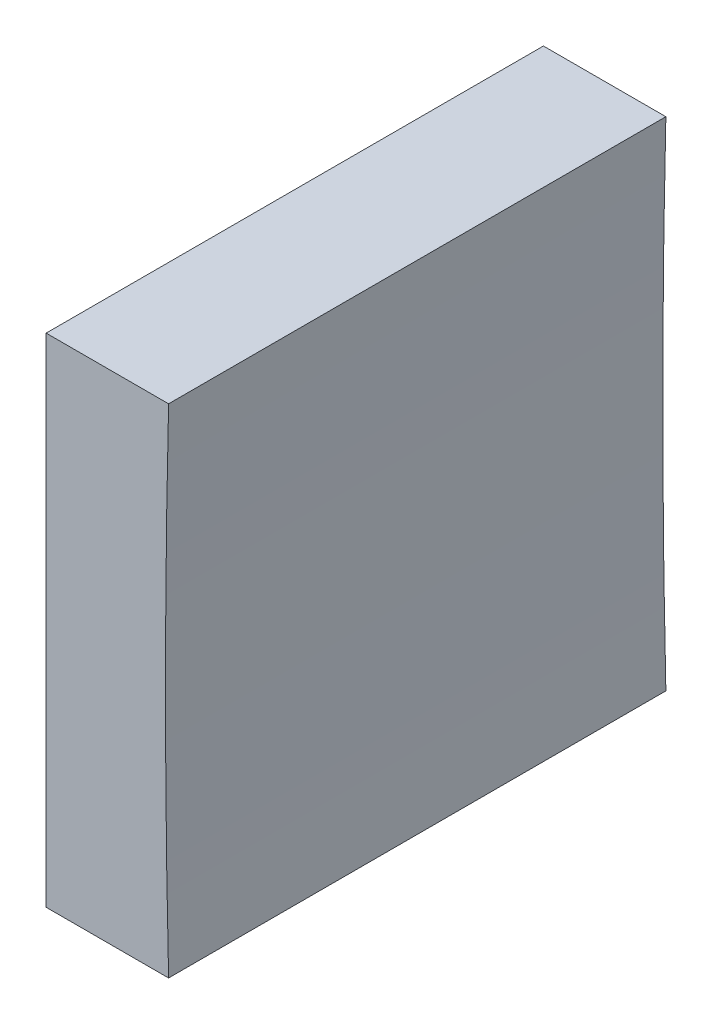
ISO-10303-21;
HEADER;
FILE_DESCRIPTION(('STEP AP214'),'2;1');
FILE_NAME('part.step','',(''),(''),'','','');
FILE_SCHEMA(('AUTOMOTIVE_DESIGN { 1 0 10303 214 1 1 1 1 }'));
ENDSEC;
DATA;
#1=APPLICATION_CONTEXT('core data for automotive mechanical design processes');
#2=APPLICATION_PROTOCOL_DEFINITION('international standard','automotive_design',2000,#1);
#3=PRODUCT_CONTEXT('',#1,'mechanical');
#4=PRODUCT('Part','Part','',(#3));
#5=PRODUCT_RELATED_PRODUCT_CATEGORY('part','',(#4));
#6=PRODUCT_DEFINITION_FORMATION('','',#4);
#7=PRODUCT_DEFINITION_CONTEXT('part definition',#1,'design');
#8=PRODUCT_DEFINITION('design','',#6,#7);
#9=PRODUCT_DEFINITION_SHAPE('','',#8);
#10=(LENGTH_UNIT() NAMED_UNIT(*) SI_UNIT(.MILLI.,.METRE.));
#11=(NAMED_UNIT(*) PLANE_ANGLE_UNIT() SI_UNIT($,.RADIAN.));
#12=(NAMED_UNIT(*) SI_UNIT($,.STERADIAN.) SOLID_ANGLE_UNIT());
#13=UNCERTAINTY_MEASURE_WITH_UNIT(LENGTH_MEASURE(1.E-05),#10,'distance_accuracy_value','');
#14=(GEOMETRIC_REPRESENTATION_CONTEXT(3) GLOBAL_UNCERTAINTY_ASSIGNED_CONTEXT((#13)) GLOBAL_UNIT_ASSIGNED_CONTEXT((#10,
#11,#12)) REPRESENTATION_CONTEXT('',''));
#15=CARTESIAN_POINT('',(0.,0.,0.));
#16=DIRECTION('',(0.,0.,1.));
#17=DIRECTION('',(1.,0.,0.));
#18=AXIS2_PLACEMENT_3D('',#15,#16,#17);
#19=CARTESIAN_POINT('',(290.863410041399,54.3579292677674,25.));
#20=DIRECTION('',(0.,1.,0.));
#21=DIRECTION('',(-1.,0.,0.));
#22=AXIS2_PLACEMENT_3D('',#19,#20,#21);
#23=PLANE('',#22);
#24=DIRECTION('',(1.,0.,0.));
#25=VECTOR('',#24,1.);
#26=CARTESIAN_POINT('',(290.863410041399,54.3579292677674,0.));
#27=LINE('',#26,#25);
#28=CARTESIAN_POINT('',(284.707135631282,54.3579292677671,0.));
#29=VERTEX_POINT('',#28);
#30=CARTESIAN_POINT('',(290.863410041399,54.3579292677675,0.));
#31=VERTEX_POINT('',#30);
#32=EDGE_CURVE('E91',#29,#31,#27,.T.);
#33=ORIENTED_EDGE('',*,*,#32,.T.);
#34=DIRECTION('',(0.,0.,-1.));
#35=VECTOR('',#34,1.);
#36=CARTESIAN_POINT('',(290.863410041399,54.3579292677675,25.));
#37=LINE('',#36,#35);
#38=CARTESIAN_POINT('',(290.863410041399,54.3579292677675,25.));
#39=VERTEX_POINT('',#38);
#40=EDGE_CURVE('E45',#39,#31,#37,.T.);
#41=ORIENTED_EDGE('',*,*,#40,.F.);
#42=DIRECTION('',(1.,0.,0.));
#43=VECTOR('',#42,1.);
#44=CARTESIAN_POINT('',(290.863410041399,54.3579292677674,25.));
#45=LINE('',#44,#43);
#46=CARTESIAN_POINT('',(284.707135631282,54.3579292677671,25.));
#47=VERTEX_POINT('',#46);
#48=EDGE_CURVE('E84',#47,#39,#45,.T.);
#49=ORIENTED_EDGE('',*,*,#48,.F.);
#50=DIRECTION('',(0.,0.,-1.));
#51=VECTOR('',#50,1.);
#52=CARTESIAN_POINT('',(284.707135631282,54.3579292677671,25.));
#53=LINE('',#52,#51);
#54=EDGE_CURVE('E11',#47,#29,#53,.T.);
#55=ORIENTED_EDGE('',*,*,#54,.T.);
#56=EDGE_LOOP('',(#33,#41,#49,#55));
#57=FACE_BOUND('',#56,.T.);
#58=ADVANCED_FACE('F37',(#57),#23,.F.);
#59=CARTESIAN_POINT('',(790.707135619705,66.8579292677661,25.));
#60=DIRECTION('',(0.,0.,-1.));
#61=DIRECTION('',(-1.,0.,0.));
#62=AXIS2_PLACEMENT_3D('',#59,#60,#61);
#63=CYLINDRICAL_SURFACE('',#62,500.);
#64=CARTESIAN_POINT('',(790.707135619705,66.8579292677661,0.));
#65=DIRECTION('',(0.,0.,-1.));
#66=DIRECTION('',(1.,0.,0.));
#67=AXIS2_PLACEMENT_3D('',#64,#65,#66);
#68=CIRCLE('',#67,500.);
#69=CARTESIAN_POINT('',(290.863410041399,79.3579292677671,0.));
#70=VERTEX_POINT('',#69);
#71=EDGE_CURVE('E71',#31,#70,#68,.T.);
#72=ORIENTED_EDGE('',*,*,#71,.T.);
#73=DIRECTION('',(0.,0.,-1.));
#74=VECTOR('',#73,1.);
#75=CARTESIAN_POINT('',(290.863410041399,79.3579292677671,25.));
#76=LINE('',#75,#74);
#77=CARTESIAN_POINT('',(290.863410041399,79.3579292677671,25.));
#78=VERTEX_POINT('',#77);
#79=EDGE_CURVE('E92',#78,#70,#76,.T.);
#80=ORIENTED_EDGE('',*,*,#79,.F.);
#81=CARTESIAN_POINT('',(790.707135619705,66.8579292677661,25.));
#82=DIRECTION('',(0.,0.,-1.));
#83=DIRECTION('',(1.,0.,0.));
#84=AXIS2_PLACEMENT_3D('',#81,#82,#83);
#85=CIRCLE('',#84,500.);
#86=EDGE_CURVE('E88',#39,#78,#85,.T.);
#87=ORIENTED_EDGE('',*,*,#86,.F.);
#88=ORIENTED_EDGE('',*,*,#40,.T.);
#89=EDGE_LOOP('',(#72,#80,#87,#88));
#90=FACE_BOUND('',#89,.T.);
#91=ADVANCED_FACE('F93',(#90),#63,.F.);
#92=CARTESIAN_POINT('',(284.707135631282,79.3579292677671,25.));
#93=DIRECTION('',(0.,-1.,0.));
#94=DIRECTION('',(0.,0.,-1.));
#95=AXIS2_PLACEMENT_3D('',#92,#93,#94);
#96=PLANE('',#95);
#97=DIRECTION('',(-1.,0.,0.));
#98=VECTOR('',#97,1.);
#99=CARTESIAN_POINT('',(284.707135631282,79.3579292677671,0.));
#100=LINE('',#99,#98);
#101=CARTESIAN_POINT('',(284.707135631282,79.3579292677671,0.));
#102=VERTEX_POINT('',#101);
#103=EDGE_CURVE('E78',#70,#102,#100,.T.);
#104=ORIENTED_EDGE('',*,*,#103,.T.);
#105=DIRECTION('',(0.,0.,-1.));
#106=VECTOR('',#105,1.);
#107=CARTESIAN_POINT('',(284.707135631282,79.3579292677671,25.));
#108=LINE('',#107,#106);
#109=CARTESIAN_POINT('',(284.707135631282,79.3579292677671,25.));
#110=VERTEX_POINT('',#109);
#111=EDGE_CURVE('E97',#110,#102,#108,.T.);
#112=ORIENTED_EDGE('',*,*,#111,.F.);
#113=DIRECTION('',(-1.,0.,0.));
#114=VECTOR('',#113,1.);
#115=CARTESIAN_POINT('',(284.707135631282,79.3579292677671,25.));
#116=LINE('',#115,#114);
#117=EDGE_CURVE('E95',#78,#110,#116,.T.);
#118=ORIENTED_EDGE('',*,*,#117,.F.);
#119=ORIENTED_EDGE('',*,*,#79,.T.);
#120=EDGE_LOOP('',(#104,#112,#118,#119));
#121=FACE_BOUND('',#120,.T.);
#122=ADVANCED_FACE('F107',(#121),#96,.F.);
#123=CARTESIAN_POINT('',(284.707135631282,66.8579292677671,25.));
#124=DIRECTION('',(1.,0.,0.));
#125=DIRECTION('',(0.,0.,-1.));
#126=AXIS2_PLACEMENT_3D('',#123,#124,#125);
#127=PLANE('',#126);
#128=DIRECTION('',(0.,-1.,0.));
#129=VECTOR('',#128,1.);
#130=CARTESIAN_POINT('',(284.707135631282,66.8579292677671,0.));
#131=LINE('',#130,#129);
#132=EDGE_CURVE('E104',#102,#29,#131,.T.);
#133=ORIENTED_EDGE('',*,*,#132,.T.);
#134=ORIENTED_EDGE('',*,*,#54,.F.);
#135=DIRECTION('',(0.,-1.,0.));
#136=VECTOR('',#135,1.);
#137=CARTESIAN_POINT('',(284.707135631282,54.3579292677671,25.));
#138=LINE('',#137,#136);
#139=EDGE_CURVE('E53',#110,#47,#138,.T.);
#140=ORIENTED_EDGE('',*,*,#139,.F.);
#141=ORIENTED_EDGE('',*,*,#111,.T.);
#142=EDGE_LOOP('',(#133,#134,#140,#141));
#143=FACE_BOUND('',#142,.T.);
#144=ADVANCED_FACE('F111',(#143),#127,.F.);
#145=CARTESIAN_POINT('',(790.707135619705,66.8579292677661,25.));
#146=DIRECTION('',(0.,0.,1.));
#147=DIRECTION('',(1.,0.,0.));
#148=AXIS2_PLACEMENT_3D('',#145,#146,#147);
#149=PLANE('',#148);
#150=ORIENTED_EDGE('',*,*,#139,.T.);
#151=ORIENTED_EDGE('',*,*,#48,.T.);
#152=ORIENTED_EDGE('',*,*,#86,.T.);
#153=ORIENTED_EDGE('',*,*,#117,.T.);
#154=EDGE_LOOP('',(#150,#151,#152,#153));
#155=FACE_BOUND('',#154,.T.);
#156=ADVANCED_FACE('F86',(#155),#149,.T.);
#157=CARTESIAN_POINT('',(790.707135619705,66.8579292677661,0.));
#158=DIRECTION('',(0.,0.,1.));
#159=DIRECTION('',(1.,0.,0.));
#160=AXIS2_PLACEMENT_3D('',#157,#158,#159);
#161=PLANE('',#160);
#162=ORIENTED_EDGE('',*,*,#32,.F.);
#163=ORIENTED_EDGE('',*,*,#132,.F.);
#164=ORIENTED_EDGE('',*,*,#103,.F.);
#165=ORIENTED_EDGE('',*,*,#71,.F.);
#166=EDGE_LOOP('',(#162,#163,#164,#165));
#167=FACE_BOUND('',#166,.T.);
#168=ADVANCED_FACE('F110',(#167),#161,.F.);
#169=CLOSED_SHELL('',(#58,#91,#122,#144,#156,#168));
#170=MANIFOLD_SOLID_BREP('B2',#169);
#171=ADVANCED_BREP_SHAPE_REPRESENTATION('',(#18,#170),#14);
#172=SHAPE_DEFINITION_REPRESENTATION(#9,#171);
ENDSEC;
END-ISO-10303-21;
